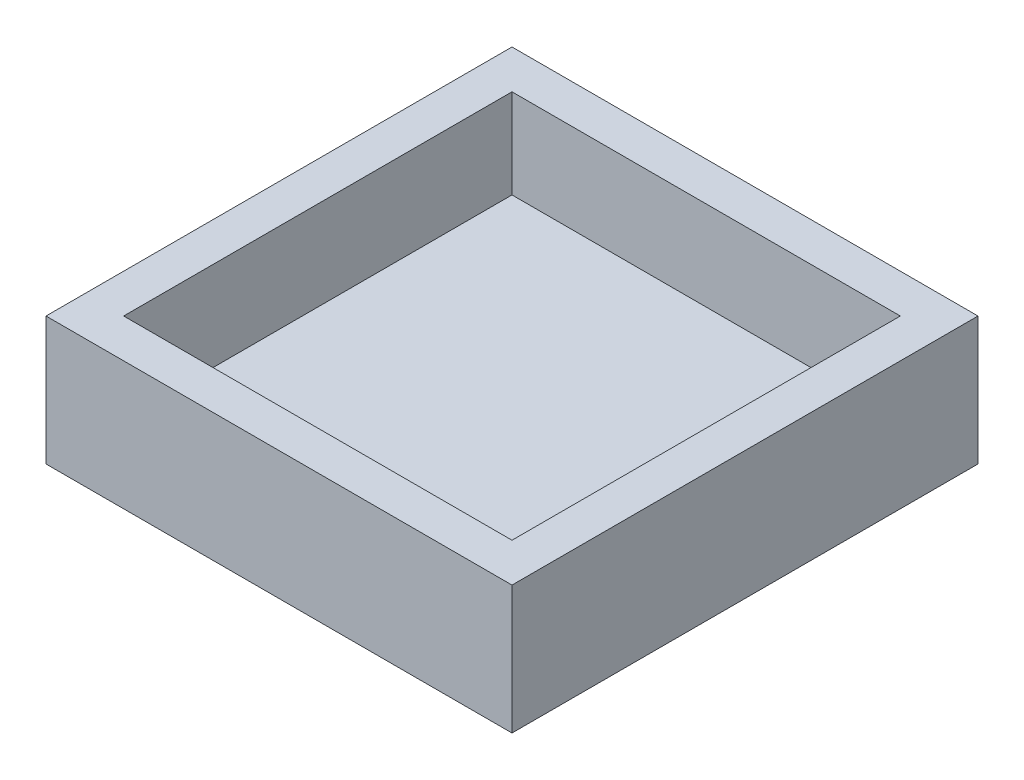
ISO-10303-21;
HEADER;
FILE_DESCRIPTION(('STEP AP214'),'2;1');
FILE_NAME('part.step','',(''),(''),'','','');
FILE_SCHEMA(('AUTOMOTIVE_DESIGN { 1 0 10303 214 1 1 1 1 }'));
ENDSEC;
DATA;
#1=APPLICATION_CONTEXT('core data for automotive mechanical design processes');
#2=APPLICATION_PROTOCOL_DEFINITION('international standard','automotive_design',2000,#1);
#3=PRODUCT_CONTEXT('',#1,'mechanical');
#4=PRODUCT('Part','Part','',(#3));
#5=PRODUCT_RELATED_PRODUCT_CATEGORY('part','',(#4));
#6=PRODUCT_DEFINITION_FORMATION('','',#4);
#7=PRODUCT_DEFINITION_CONTEXT('part definition',#1,'design');
#8=PRODUCT_DEFINITION('design','',#6,#7);
#9=PRODUCT_DEFINITION_SHAPE('','',#8);
#10=(LENGTH_UNIT() NAMED_UNIT(*) SI_UNIT(.MILLI.,.METRE.));
#11=(NAMED_UNIT(*) PLANE_ANGLE_UNIT() SI_UNIT($,.RADIAN.));
#12=(NAMED_UNIT(*) SI_UNIT($,.STERADIAN.) SOLID_ANGLE_UNIT());
#13=UNCERTAINTY_MEASURE_WITH_UNIT(LENGTH_MEASURE(1.E-05),#10,'distance_accuracy_value','');
#14=(GEOMETRIC_REPRESENTATION_CONTEXT(3) GLOBAL_UNCERTAINTY_ASSIGNED_CONTEXT((#13)) GLOBAL_UNIT_ASSIGNED_CONTEXT((#10,
#11,#12)) REPRESENTATION_CONTEXT('',''));
#15=CARTESIAN_POINT('',(0.,0.,0.));
#16=DIRECTION('',(0.,0.,1.));
#17=DIRECTION('',(1.,0.,0.));
#18=AXIS2_PLACEMENT_3D('',#15,#16,#17);
#19=CARTESIAN_POINT('',(-54.6107784431138,33.,-53.5329341317365));
#20=DIRECTION('',(1.,0.,0.));
#21=DIRECTION('',(0.,0.,-1.));
#22=AXIS2_PLACEMENT_3D('',#19,#20,#21);
#23=PLANE('',#22);
#24=DIRECTION('',(0.,0.,1.));
#25=VECTOR('',#24,1.);
#26=CARTESIAN_POINT('',(-54.6107784431138,0.,-53.5329341317365));
#27=LINE('',#26,#25);
#28=CARTESIAN_POINT('',(-54.6107784431138,0.,-53.5329341317365));
#29=VERTEX_POINT('',#28);
#30=CARTESIAN_POINT('',(-54.6107784431138,0.,66.4670658682635));
#31=VERTEX_POINT('',#30);
#32=EDGE_CURVE('E171',#29,#31,#27,.T.);
#33=ORIENTED_EDGE('',*,*,#32,.T.);
#34=DIRECTION('',(0.,-1.,0.));
#35=VECTOR('',#34,1.);
#36=CARTESIAN_POINT('',(-54.6107784431138,33.,66.4670658682635));
#37=LINE('',#36,#35);
#38=CARTESIAN_POINT('',(-54.6107784431138,33.,66.4670658682635));
#39=VERTEX_POINT('',#38);
#40=EDGE_CURVE('E11',#39,#31,#37,.T.);
#41=ORIENTED_EDGE('',*,*,#40,.F.);
#42=DIRECTION('',(0.,0.,1.));
#43=VECTOR('',#42,1.);
#44=CARTESIAN_POINT('',(-54.6107784431138,33.,-53.5329341317365));
#45=LINE('',#44,#43);
#46=CARTESIAN_POINT('',(-54.6107784431138,33.,-53.5329341317365));
#47=VERTEX_POINT('',#46);
#48=EDGE_CURVE('E160',#47,#39,#45,.T.);
#49=ORIENTED_EDGE('',*,*,#48,.F.);
#50=DIRECTION('',(0.,-1.,0.));
#51=VECTOR('',#50,1.);
#52=CARTESIAN_POINT('',(-54.6107784431138,33.,-53.5329341317365));
#53=LINE('',#52,#51);
#54=EDGE_CURVE('E170',#47,#29,#53,.T.);
#55=ORIENTED_EDGE('',*,*,#54,.T.);
#56=EDGE_LOOP('',(#33,#41,#49,#55));
#57=FACE_BOUND('',#56,.T.);
#58=ADVANCED_FACE('F43',(#57),#23,.F.);
#59=CARTESIAN_POINT('',(-54.6107784431138,33.,66.4670658682635));
#60=DIRECTION('',(0.,0.,-1.));
#61=DIRECTION('',(-1.,0.,0.));
#62=AXIS2_PLACEMENT_3D('',#59,#60,#61);
#63=PLANE('',#62);
#64=DIRECTION('',(1.,0.,0.));
#65=VECTOR('',#64,1.);
#66=CARTESIAN_POINT('',(-54.6107784431138,0.,66.4670658682635));
#67=LINE('',#66,#65);
#68=CARTESIAN_POINT('',(65.3892215568862,0.,66.4670658682635));
#69=VERTEX_POINT('',#68);
#70=EDGE_CURVE('E175',#31,#69,#67,.T.);
#71=ORIENTED_EDGE('',*,*,#70,.T.);
#72=DIRECTION('',(0.,-1.,0.));
#73=VECTOR('',#72,1.);
#74=CARTESIAN_POINT('',(65.3892215568862,33.,66.4670658682635));
#75=LINE('',#74,#73);
#76=CARTESIAN_POINT('',(65.3892215568862,33.,66.4670658682635));
#77=VERTEX_POINT('',#76);
#78=EDGE_CURVE('E51',#77,#69,#75,.T.);
#79=ORIENTED_EDGE('',*,*,#78,.F.);
#80=DIRECTION('',(1.,0.,0.));
#81=VECTOR('',#80,1.);
#82=CARTESIAN_POINT('',(-54.6107784431138,33.,66.4670658682635));
#83=LINE('',#82,#81);
#84=EDGE_CURVE('E95',#39,#77,#83,.T.);
#85=ORIENTED_EDGE('',*,*,#84,.F.);
#86=ORIENTED_EDGE('',*,*,#40,.T.);
#87=EDGE_LOOP('',(#71,#79,#85,#86));
#88=FACE_BOUND('',#87,.T.);
#89=ADVANCED_FACE('F210',(#88),#63,.F.);
#90=CARTESIAN_POINT('',(65.3892215568862,33.,-53.5329341317365));
#91=DIRECTION('',(-1.,0.,0.));
#92=DIRECTION('',(0.,0.,1.));
#93=AXIS2_PLACEMENT_3D('',#90,#91,#92);
#94=PLANE('',#93);
#95=DIRECTION('',(0.,0.,-1.));
#96=VECTOR('',#95,1.);
#97=CARTESIAN_POINT('',(65.3892215568862,0.,-53.5329341317365));
#98=LINE('',#97,#96);
#99=CARTESIAN_POINT('',(65.3892215568862,0.,-53.5329341317365));
#100=VERTEX_POINT('',#99);
#101=EDGE_CURVE('E178',#69,#100,#98,.T.);
#102=ORIENTED_EDGE('',*,*,#101,.T.);
#103=DIRECTION('',(0.,-1.,0.));
#104=VECTOR('',#103,1.);
#105=CARTESIAN_POINT('',(65.3892215568862,33.,-53.5329341317365));
#106=LINE('',#105,#104);
#107=CARTESIAN_POINT('',(65.3892215568862,33.,-53.5329341317365));
#108=VERTEX_POINT('',#107);
#109=EDGE_CURVE('E185',#108,#100,#106,.T.);
#110=ORIENTED_EDGE('',*,*,#109,.F.);
#111=DIRECTION('',(0.,0.,-1.));
#112=VECTOR('',#111,1.);
#113=CARTESIAN_POINT('',(65.3892215568862,33.,-53.5329341317365));
#114=LINE('',#113,#112);
#115=EDGE_CURVE('E165',#77,#108,#114,.T.);
#116=ORIENTED_EDGE('',*,*,#115,.F.);
#117=ORIENTED_EDGE('',*,*,#78,.T.);
#118=EDGE_LOOP('',(#102,#110,#116,#117));
#119=FACE_BOUND('',#118,.T.);
#120=ADVANCED_FACE('F192',(#119),#94,.F.);
#121=CARTESIAN_POINT('',(-54.6107784431138,33.,-53.5329341317365));
#122=DIRECTION('',(0.,0.,1.));
#123=DIRECTION('',(1.,0.,0.));
#124=AXIS2_PLACEMENT_3D('',#121,#122,#123);
#125=PLANE('',#124);
#126=DIRECTION('',(-1.,0.,0.));
#127=VECTOR('',#126,1.);
#128=CARTESIAN_POINT('',(-54.6107784431138,0.,-53.5329341317365));
#129=LINE('',#128,#127);
#130=EDGE_CURVE('E88',#100,#29,#129,.T.);
#131=ORIENTED_EDGE('',*,*,#130,.T.);
#132=ORIENTED_EDGE('',*,*,#54,.F.);
#133=DIRECTION('',(-1.,0.,0.));
#134=VECTOR('',#133,1.);
#135=CARTESIAN_POINT('',(-54.6107784431138,33.,-53.5329341317365));
#136=LINE('',#135,#134);
#137=EDGE_CURVE('E67',#108,#47,#136,.T.);
#138=ORIENTED_EDGE('',*,*,#137,.F.);
#139=ORIENTED_EDGE('',*,*,#109,.T.);
#140=EDGE_LOOP('',(#131,#132,#138,#139));
#141=FACE_BOUND('',#140,.T.);
#142=ADVANCED_FACE('F200',(#141),#125,.F.);
#143=CARTESIAN_POINT('',(0.,33.,0.));
#144=DIRECTION('',(0.,1.,0.));
#145=DIRECTION('',(0.,0.,1.));
#146=AXIS2_PLACEMENT_3D('',#143,#144,#145);
#147=PLANE('',#146);
#148=DIRECTION('',(0.,0.,1.));
#149=VECTOR('',#148,1.);
#150=CARTESIAN_POINT('',(-44.6107784431138,33.,-53.5329341317365));
#151=LINE('',#150,#149);
#152=CARTESIAN_POINT('',(-44.6107784431138,33.,-43.5329341317365));
#153=VERTEX_POINT('',#152);
#154=CARTESIAN_POINT('',(-44.6107784431138,33.,56.4670658682635));
#155=VERTEX_POINT('',#154);
#156=EDGE_CURVE('E144',#153,#155,#151,.T.);
#157=ORIENTED_EDGE('',*,*,#156,.F.);
#158=DIRECTION('',(-1.,0.,0.));
#159=VECTOR('',#158,1.);
#160=CARTESIAN_POINT('',(-54.6107784431138,33.,-43.5329341317365));
#161=LINE('',#160,#159);
#162=CARTESIAN_POINT('',(55.3892215568862,33.,-43.5329341317365));
#163=VERTEX_POINT('',#162);
#164=EDGE_CURVE('E157',#163,#153,#161,.T.);
#165=ORIENTED_EDGE('',*,*,#164,.F.);
#166=DIRECTION('',(0.,0.,-1.));
#167=VECTOR('',#166,1.);
#168=CARTESIAN_POINT('',(55.3892215568862,33.,-53.5329341317365));
#169=LINE('',#168,#167);
#170=CARTESIAN_POINT('',(55.3892215568862,33.,56.4670658682635));
#171=VERTEX_POINT('',#170);
#172=EDGE_CURVE('E154',#171,#163,#169,.T.);
#173=ORIENTED_EDGE('',*,*,#172,.F.);
#174=DIRECTION('',(1.,0.,0.));
#175=VECTOR('',#174,1.);
#176=CARTESIAN_POINT('',(-54.6107784431138,33.,56.4670658682635));
#177=LINE('',#176,#175);
#178=EDGE_CURVE('E133',#155,#171,#177,.T.);
#179=ORIENTED_EDGE('',*,*,#178,.F.);
#180=EDGE_LOOP('',(#157,#165,#173,#179));
#181=FACE_BOUND('',#180,.T.);
#182=ORIENTED_EDGE('',*,*,#48,.T.);
#183=ORIENTED_EDGE('',*,*,#84,.T.);
#184=ORIENTED_EDGE('',*,*,#115,.T.);
#185=ORIENTED_EDGE('',*,*,#137,.T.);
#186=EDGE_LOOP('',(#182,#183,#184,#185));
#187=FACE_BOUND('',#186,.T.);
#188=ADVANCED_FACE('F202',(#181,#187),#147,.T.);
#189=CARTESIAN_POINT('',(0.,0.,0.));
#190=DIRECTION('',(0.,1.,0.));
#191=DIRECTION('',(0.,0.,1.));
#192=AXIS2_PLACEMENT_3D('',#189,#190,#191);
#193=PLANE('',#192);
#194=ORIENTED_EDGE('',*,*,#32,.F.);
#195=ORIENTED_EDGE('',*,*,#130,.F.);
#196=ORIENTED_EDGE('',*,*,#101,.F.);
#197=ORIENTED_EDGE('',*,*,#70,.F.);
#198=EDGE_LOOP('',(#194,#195,#196,#197));
#199=FACE_BOUND('',#198,.T.);
#200=ADVANCED_FACE('F196',(#199),#193,.F.);
#201=CARTESIAN_POINT('',(-44.6107784431138,33.,-53.5329341317365));
#202=DIRECTION('',(1.,0.,0.));
#203=DIRECTION('',(0.,0.,-1.));
#204=AXIS2_PLACEMENT_3D('',#201,#202,#203);
#205=PLANE('',#204);
#206=DIRECTION('',(0.,0.,1.));
#207=VECTOR('',#206,1.);
#208=CARTESIAN_POINT('',(-44.6107784431138,10.,-53.5329341317365));
#209=LINE('',#208,#207);
#210=CARTESIAN_POINT('',(-44.6107784431138,10.,-43.5329341317365));
#211=VERTEX_POINT('',#210);
#212=CARTESIAN_POINT('',(-44.6107784431138,10.,56.4670658682635));
#213=VERTEX_POINT('',#212);
#214=EDGE_CURVE('E123',#211,#213,#209,.T.);
#215=ORIENTED_EDGE('',*,*,#214,.F.);
#216=DIRECTION('',(0.,-1.,0.));
#217=VECTOR('',#216,1.);
#218=CARTESIAN_POINT('',(-44.6107784431138,33.,-43.5329341317365));
#219=LINE('',#218,#217);
#220=EDGE_CURVE('E148',#153,#211,#219,.T.);
#221=ORIENTED_EDGE('',*,*,#220,.F.);
#222=ORIENTED_EDGE('',*,*,#156,.T.);
#223=DIRECTION('',(0.,-1.,0.));
#224=VECTOR('',#223,1.);
#225=CARTESIAN_POINT('',(-44.6107784431138,33.,56.4670658682635));
#226=LINE('',#225,#224);
#227=EDGE_CURVE('E137',#155,#213,#226,.T.);
#228=ORIENTED_EDGE('',*,*,#227,.T.);
#229=EDGE_LOOP('',(#215,#221,#222,#228));
#230=FACE_BOUND('',#229,.T.);
#231=ADVANCED_FACE('F239',(#230),#205,.T.);
#232=CARTESIAN_POINT('',(-54.6107784431138,33.,56.4670658682635));
#233=DIRECTION('',(0.,0.,-1.));
#234=DIRECTION('',(-1.,0.,0.));
#235=AXIS2_PLACEMENT_3D('',#232,#233,#234);
#236=PLANE('',#235);
#237=DIRECTION('',(1.,0.,0.));
#238=VECTOR('',#237,1.);
#239=CARTESIAN_POINT('',(-54.6107784431138,10.,56.4670658682635));
#240=LINE('',#239,#238);
#241=CARTESIAN_POINT('',(55.3892215568862,10.,56.4670658682635));
#242=VERTEX_POINT('',#241);
#243=EDGE_CURVE('E117',#213,#242,#240,.T.);
#244=ORIENTED_EDGE('',*,*,#243,.F.);
#245=ORIENTED_EDGE('',*,*,#227,.F.);
#246=ORIENTED_EDGE('',*,*,#178,.T.);
#247=DIRECTION('',(0.,-1.,0.));
#248=VECTOR('',#247,1.);
#249=CARTESIAN_POINT('',(55.3892215568862,33.,56.4670658682635));
#250=LINE('',#249,#248);
#251=EDGE_CURVE('E130',#171,#242,#250,.T.);
#252=ORIENTED_EDGE('',*,*,#251,.T.);
#253=EDGE_LOOP('',(#244,#245,#246,#252));
#254=FACE_BOUND('',#253,.T.);
#255=ADVANCED_FACE('F131',(#254),#236,.T.);
#256=CARTESIAN_POINT('',(55.3892215568862,33.,-53.5329341317365));
#257=DIRECTION('',(-1.,0.,0.));
#258=DIRECTION('',(0.,0.,1.));
#259=AXIS2_PLACEMENT_3D('',#256,#257,#258);
#260=PLANE('',#259);
#261=DIRECTION('',(0.,0.,-1.));
#262=VECTOR('',#261,1.);
#263=CARTESIAN_POINT('',(55.3892215568862,10.,-53.5329341317365));
#264=LINE('',#263,#262);
#265=CARTESIAN_POINT('',(55.3892215568862,10.,-43.5329341317365));
#266=VERTEX_POINT('',#265);
#267=EDGE_CURVE('E121',#242,#266,#264,.T.);
#268=ORIENTED_EDGE('',*,*,#267,.F.);
#269=ORIENTED_EDGE('',*,*,#251,.F.);
#270=ORIENTED_EDGE('',*,*,#172,.T.);
#271=DIRECTION('',(0.,-1.,0.));
#272=VECTOR('',#271,1.);
#273=CARTESIAN_POINT('',(55.3892215568862,33.,-43.5329341317365));
#274=LINE('',#273,#272);
#275=EDGE_CURVE('E58',#163,#266,#274,.T.);
#276=ORIENTED_EDGE('',*,*,#275,.T.);
#277=EDGE_LOOP('',(#268,#269,#270,#276));
#278=FACE_BOUND('',#277,.T.);
#279=ADVANCED_FACE('F139',(#278),#260,.T.);
#280=CARTESIAN_POINT('',(-54.6107784431138,33.,-43.5329341317365));
#281=DIRECTION('',(0.,0.,1.));
#282=DIRECTION('',(1.,0.,0.));
#283=AXIS2_PLACEMENT_3D('',#280,#281,#282);
#284=PLANE('',#283);
#285=DIRECTION('',(-1.,0.,0.));
#286=VECTOR('',#285,1.);
#287=CARTESIAN_POINT('',(-54.6107784431138,10.,-43.5329341317365));
#288=LINE('',#287,#286);
#289=EDGE_CURVE('E141',#266,#211,#288,.T.);
#290=ORIENTED_EDGE('',*,*,#289,.F.);
#291=ORIENTED_EDGE('',*,*,#275,.F.);
#292=ORIENTED_EDGE('',*,*,#164,.T.);
#293=ORIENTED_EDGE('',*,*,#220,.T.);
#294=EDGE_LOOP('',(#290,#291,#292,#293));
#295=FACE_BOUND('',#294,.T.);
#296=ADVANCED_FACE('F273',(#295),#284,.T.);
#297=CARTESIAN_POINT('',(0.,10.,0.));
#298=DIRECTION('',(0.,1.,0.));
#299=DIRECTION('',(0.,0.,1.));
#300=AXIS2_PLACEMENT_3D('',#297,#298,#299);
#301=PLANE('',#300);
#302=ORIENTED_EDGE('',*,*,#214,.T.);
#303=ORIENTED_EDGE('',*,*,#243,.T.);
#304=ORIENTED_EDGE('',*,*,#267,.T.);
#305=ORIENTED_EDGE('',*,*,#289,.T.);
#306=EDGE_LOOP('',(#302,#303,#304,#305));
#307=FACE_BOUND('',#306,.T.);
#308=ADVANCED_FACE('F119',(#307),#301,.T.);
#309=CLOSED_SHELL('',(#58,#89,#120,#142,#188,#200,#231,#255,#279,#296,#308));
#310=MANIFOLD_SOLID_BREP('B2',#309);
#311=ADVANCED_BREP_SHAPE_REPRESENTATION('',(#18,#310),#14);
#312=SHAPE_DEFINITION_REPRESENTATION(#9,#311);
ENDSEC;
END-ISO-10303-21;
